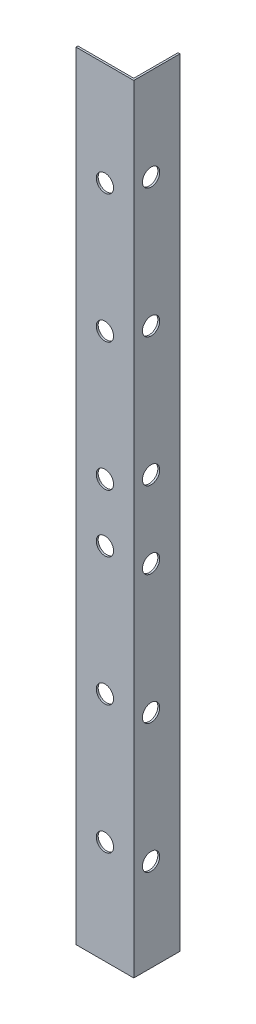
ISO-10303-21;
HEADER;
FILE_DESCRIPTION(('STEP AP214'),'2;1');
FILE_NAME('part.step','',(''),(''),'','','');
FILE_SCHEMA(('AUTOMOTIVE_DESIGN { 1 0 10303 214 1 1 1 1 }'));
ENDSEC;
DATA;
#1=APPLICATION_CONTEXT('core data for automotive mechanical design processes');
#2=APPLICATION_PROTOCOL_DEFINITION('international standard','automotive_design',2000,#1);
#3=PRODUCT_CONTEXT('',#1,'mechanical');
#4=PRODUCT('Part','Part','',(#3));
#5=PRODUCT_RELATED_PRODUCT_CATEGORY('part','',(#4));
#6=PRODUCT_DEFINITION_FORMATION('','',#4);
#7=PRODUCT_DEFINITION_CONTEXT('part definition',#1,'design');
#8=PRODUCT_DEFINITION('design','',#6,#7);
#9=PRODUCT_DEFINITION_SHAPE('','',#8);
#10=(LENGTH_UNIT() NAMED_UNIT(*) SI_UNIT(.MILLI.,.METRE.));
#11=(NAMED_UNIT(*) PLANE_ANGLE_UNIT() SI_UNIT($,.RADIAN.));
#12=(NAMED_UNIT(*) SI_UNIT($,.STERADIAN.) SOLID_ANGLE_UNIT());
#13=UNCERTAINTY_MEASURE_WITH_UNIT(LENGTH_MEASURE(1.E-05),#10,'distance_accuracy_value','');
#14=(GEOMETRIC_REPRESENTATION_CONTEXT(3) GLOBAL_UNCERTAINTY_ASSIGNED_CONTEXT((#13)) GLOBAL_UNIT_ASSIGNED_CONTEXT((#10,
#11,#12)) REPRESENTATION_CONTEXT('',''));
#15=CARTESIAN_POINT('',(0.,0.,0.));
#16=DIRECTION('',(0.,0.,1.));
#17=DIRECTION('',(1.,0.,0.));
#18=AXIS2_PLACEMENT_3D('',#15,#16,#17);
#19=CARTESIAN_POINT('',(0.,202.,-0.5));
#20=DIRECTION('',(1.,0.,0.));
#21=DIRECTION('',(0.,0.,-1.));
#22=AXIS2_PLACEMENT_3D('',#19,#20,#21);
#23=PLANE('',#22);
#24=DIRECTION('',(0.,0.,1.));
#25=VECTOR('',#24,1.);
#26=CARTESIAN_POINT('',(0.,0.,-0.5));
#27=LINE('',#26,#25);
#28=CARTESIAN_POINT('',(0.,0.,-0.5));
#29=VERTEX_POINT('',#28);
#30=CARTESIAN_POINT('',(0.,0.,0.));
#31=VERTEX_POINT('',#30);
#32=EDGE_CURVE('E123',#29,#31,#27,.T.);
#33=ORIENTED_EDGE('',*,*,#32,.T.);
#34=DIRECTION('',(0.,-1.,0.));
#35=VECTOR('',#34,1.);
#36=CARTESIAN_POINT('',(0.,202.,0.));
#37=LINE('',#36,#35);
#38=CARTESIAN_POINT('',(0.,202.,0.));
#39=VERTEX_POINT('',#38);
#40=EDGE_CURVE('E11',#39,#31,#37,.T.);
#41=ORIENTED_EDGE('',*,*,#40,.F.);
#42=DIRECTION('',(0.,0.,1.));
#43=VECTOR('',#42,1.);
#44=CARTESIAN_POINT('',(0.,202.,-0.5));
#45=LINE('',#44,#43);
#46=CARTESIAN_POINT('',(0.,202.,-0.5));
#47=VERTEX_POINT('',#46);
#48=EDGE_CURVE('E134',#47,#39,#45,.T.);
#49=ORIENTED_EDGE('',*,*,#48,.F.);
#50=DIRECTION('',(0.,-1.,0.));
#51=VECTOR('',#50,1.);
#52=CARTESIAN_POINT('',(0.,202.,-0.5));
#53=LINE('',#52,#51);
#54=EDGE_CURVE('E119',#47,#29,#53,.T.);
#55=ORIENTED_EDGE('',*,*,#54,.T.);
#56=EDGE_LOOP('',(#33,#41,#49,#55));
#57=FACE_BOUND('',#56,.T.);
#58=ADVANCED_FACE('F39',(#57),#23,.F.);
#59=CARTESIAN_POINT('',(0.,202.,0.));
#60=DIRECTION('',(0.,0.,-1.));
#61=DIRECTION('',(-1.,0.,0.));
#62=AXIS2_PLACEMENT_3D('',#59,#60,#61);
#63=PLANE('',#62);
#64=CARTESIAN_POINT('',(7.50000000000005,175.166666666667,0.));
#65=DIRECTION('',(0.,0.,1.));
#66=DIRECTION('',(1.,0.,0.));
#67=AXIS2_PLACEMENT_3D('',#64,#65,#66);
#68=CIRCLE('',#67,2.24999999999998);
#69=CARTESIAN_POINT('',(9.75000000000003,175.166666666667,0.));
#70=VERTEX_POINT('',#69);
#71=EDGE_CURVE('E463',#70,#70,#68,.T.);
#72=ORIENTED_EDGE('',*,*,#71,.F.);
#73=EDGE_LOOP('',(#72));
#74=FACE_BOUND('',#73,.T.);
#75=CARTESIAN_POINT('',(7.50000000000005,141.833333333333,0.));
#76=DIRECTION('',(0.,0.,1.));
#77=DIRECTION('',(1.,0.,0.));
#78=AXIS2_PLACEMENT_3D('',#75,#76,#77);
#79=CIRCLE('',#78,2.25);
#80=CARTESIAN_POINT('',(9.75000000000005,141.833333333333,0.));
#81=VERTEX_POINT('',#80);
#82=EDGE_CURVE('E466',#81,#81,#79,.T.);
#83=ORIENTED_EDGE('',*,*,#82,.F.);
#84=EDGE_LOOP('',(#83));
#85=FACE_BOUND('',#84,.T.);
#86=CARTESIAN_POINT('',(7.50000000000005,108.5,0.));
#87=DIRECTION('',(0.,0.,1.));
#88=DIRECTION('',(1.,0.,0.));
#89=AXIS2_PLACEMENT_3D('',#86,#87,#88);
#90=CIRCLE('',#89,2.25);
#91=CARTESIAN_POINT('',(9.75000000000005,108.5,0.));
#92=VERTEX_POINT('',#91);
#93=EDGE_CURVE('E472',#92,#92,#90,.T.);
#94=ORIENTED_EDGE('',*,*,#93,.F.);
#95=EDGE_LOOP('',(#94));
#96=FACE_BOUND('',#95,.T.);
#97=CARTESIAN_POINT('',(7.50000000000005,93.5,0.));
#98=DIRECTION('',(0.,0.,1.));
#99=DIRECTION('',(1.,0.,0.));
#100=AXIS2_PLACEMENT_3D('',#97,#98,#99);
#101=CIRCLE('',#100,2.25);
#102=CARTESIAN_POINT('',(9.75000000000005,93.5,0.));
#103=VERTEX_POINT('',#102);
#104=EDGE_CURVE('E478',#103,#103,#101,.T.);
#105=ORIENTED_EDGE('',*,*,#104,.F.);
#106=EDGE_LOOP('',(#105));
#107=FACE_BOUND('',#106,.T.);
#108=CARTESIAN_POINT('',(7.50000000000005,60.1666666666667,0.));
#109=DIRECTION('',(0.,0.,1.));
#110=DIRECTION('',(1.,0.,0.));
#111=AXIS2_PLACEMENT_3D('',#108,#109,#110);
#112=CIRCLE('',#111,2.24999999999998);
#113=CARTESIAN_POINT('',(9.75000000000003,60.1666666666667,0.));
#114=VERTEX_POINT('',#113);
#115=EDGE_CURVE('E484',#114,#114,#112,.T.);
#116=ORIENTED_EDGE('',*,*,#115,.F.);
#117=EDGE_LOOP('',(#116));
#118=FACE_BOUND('',#117,.T.);
#119=CARTESIAN_POINT('',(7.50000000000005,26.8333333333334,0.));
#120=DIRECTION('',(0.,0.,1.));
#121=DIRECTION('',(1.,0.,0.));
#122=AXIS2_PLACEMENT_3D('',#119,#120,#121);
#123=CIRCLE('',#122,2.24999999999999);
#124=CARTESIAN_POINT('',(9.75000000000004,26.8333333333334,0.));
#125=VERTEX_POINT('',#124);
#126=EDGE_CURVE('E429',#125,#125,#123,.T.);
#127=ORIENTED_EDGE('',*,*,#126,.F.);
#128=EDGE_LOOP('',(#127));
#129=FACE_BOUND('',#128,.T.);
#130=DIRECTION('',(1.,0.,0.));
#131=VECTOR('',#130,1.);
#132=CARTESIAN_POINT('',(0.,0.,0.));
#133=LINE('',#132,#131);
#134=CARTESIAN_POINT('',(15.,0.,0.));
#135=VERTEX_POINT('',#134);
#136=EDGE_CURVE('E126',#31,#135,#133,.T.);
#137=ORIENTED_EDGE('',*,*,#136,.T.);
#138=DIRECTION('',(0.,-1.,0.));
#139=VECTOR('',#138,1.);
#140=CARTESIAN_POINT('',(15.,202.,0.));
#141=LINE('',#140,#139);
#142=CARTESIAN_POINT('',(15.,202.,0.));
#143=VERTEX_POINT('',#142);
#144=EDGE_CURVE('E47',#143,#135,#141,.T.);
#145=ORIENTED_EDGE('',*,*,#144,.F.);
#146=DIRECTION('',(1.,0.,0.));
#147=VECTOR('',#146,1.);
#148=CARTESIAN_POINT('',(0.,202.,0.));
#149=LINE('',#148,#147);
#150=EDGE_CURVE('E92',#39,#143,#149,.T.);
#151=ORIENTED_EDGE('',*,*,#150,.F.);
#152=ORIENTED_EDGE('',*,*,#40,.T.);
#153=EDGE_LOOP('',(#137,#145,#151,#152));
#154=FACE_BOUND('',#153,.T.);
#155=ADVANCED_FACE('F164',(#74,#85,#96,#107,#118,#129,#154),#63,.F.);
#156=CARTESIAN_POINT('',(15.,202.,0.));
#157=DIRECTION('',(-1.,0.,0.));
#158=DIRECTION('',(0.,0.,1.));
#159=AXIS2_PLACEMENT_3D('',#156,#157,#158);
#160=PLANE('',#159);
#161=CARTESIAN_POINT('',(15.,23.9999999999999,-4.50000000000011));
#162=DIRECTION('',(1.,0.,0.));
#163=DIRECTION('',(0.,0.,-1.));
#164=AXIS2_PLACEMENT_3D('',#161,#162,#163);
#165=CIRCLE('',#164,2.24999999999999);
#166=CARTESIAN_POINT('',(15.,23.9999999999999,-6.7500000000001));
#167=VERTEX_POINT('',#166);
#168=EDGE_CURVE('E422',#167,#167,#165,.T.);
#169=ORIENTED_EDGE('',*,*,#168,.F.);
#170=EDGE_LOOP('',(#169));
#171=FACE_BOUND('',#170,.T.);
#172=CARTESIAN_POINT('',(15.,57.4999999999999,-4.50000000000011));
#173=DIRECTION('',(1.,0.,0.));
#174=DIRECTION('',(0.,0.,-1.));
#175=AXIS2_PLACEMENT_3D('',#172,#173,#174);
#176=CIRCLE('',#175,2.24999999999999);
#177=CARTESIAN_POINT('',(15.,57.4999999999999,-6.7500000000001));
#178=VERTEX_POINT('',#177);
#179=EDGE_CURVE('E431',#178,#178,#176,.T.);
#180=ORIENTED_EDGE('',*,*,#179,.F.);
#181=EDGE_LOOP('',(#180));
#182=FACE_BOUND('',#181,.T.);
#183=CARTESIAN_POINT('',(15.,90.9999999999999,-4.50000000000006));
#184=DIRECTION('',(1.,0.,0.));
#185=DIRECTION('',(0.,0.,-1.));
#186=AXIS2_PLACEMENT_3D('',#183,#184,#185);
#187=CIRCLE('',#186,2.24999999999999);
#188=CARTESIAN_POINT('',(15.,90.9999999999999,-6.75000000000005));
#189=VERTEX_POINT('',#188);
#190=EDGE_CURVE('E437',#189,#189,#187,.T.);
#191=ORIENTED_EDGE('',*,*,#190,.F.);
#192=EDGE_LOOP('',(#191));
#193=FACE_BOUND('',#192,.T.);
#194=CARTESIAN_POINT('',(15.,111.,-4.50000000000006));
#195=DIRECTION('',(1.,0.,0.));
#196=DIRECTION('',(0.,0.,-1.));
#197=AXIS2_PLACEMENT_3D('',#194,#195,#196);
#198=CIRCLE('',#197,2.24999999999999);
#199=CARTESIAN_POINT('',(15.,111.,-6.75000000000005));
#200=VERTEX_POINT('',#199);
#201=EDGE_CURVE('E443',#200,#200,#198,.T.);
#202=ORIENTED_EDGE('',*,*,#201,.F.);
#203=EDGE_LOOP('',(#202));
#204=FACE_BOUND('',#203,.T.);
#205=CARTESIAN_POINT('',(15.,144.5,-4.50000000000011));
#206=DIRECTION('',(1.,0.,0.));
#207=DIRECTION('',(0.,0.,-1.));
#208=AXIS2_PLACEMENT_3D('',#205,#206,#207);
#209=CIRCLE('',#208,2.25);
#210=CARTESIAN_POINT('',(15.,144.5,-6.75000000000012));
#211=VERTEX_POINT('',#210);
#212=EDGE_CURVE('E449',#211,#211,#209,.T.);
#213=ORIENTED_EDGE('',*,*,#212,.F.);
#214=EDGE_LOOP('',(#213));
#215=FACE_BOUND('',#214,.T.);
#216=CARTESIAN_POINT('',(15.,178.,-4.50000000000011));
#217=DIRECTION('',(1.,0.,0.));
#218=DIRECTION('',(0.,0.,-1.));
#219=AXIS2_PLACEMENT_3D('',#216,#217,#218);
#220=CIRCLE('',#219,2.25);
#221=CARTESIAN_POINT('',(15.,178.,-6.75000000000012));
#222=VERTEX_POINT('',#221);
#223=EDGE_CURVE('E455',#222,#222,#220,.T.);
#224=ORIENTED_EDGE('',*,*,#223,.F.);
#225=EDGE_LOOP('',(#224));
#226=FACE_BOUND('',#225,.T.);
#227=DIRECTION('',(0.,0.,-1.));
#228=VECTOR('',#227,1.);
#229=CARTESIAN_POINT('',(15.,0.,0.));
#230=LINE('',#229,#228);
#231=CARTESIAN_POINT('',(15.,0.,-12.));
#232=VERTEX_POINT('',#231);
#233=EDGE_CURVE('E129',#135,#232,#230,.T.);
#234=ORIENTED_EDGE('',*,*,#233,.T.);
#235=DIRECTION('',(0.,-1.,0.));
#236=VECTOR('',#235,1.);
#237=CARTESIAN_POINT('',(15.,202.,-12.));
#238=LINE('',#237,#236);
#239=CARTESIAN_POINT('',(15.,202.,-12.));
#240=VERTEX_POINT('',#239);
#241=EDGE_CURVE('E114',#240,#232,#238,.T.);
#242=ORIENTED_EDGE('',*,*,#241,.F.);
#243=DIRECTION('',(0.,0.,-1.));
#244=VECTOR('',#243,1.);
#245=CARTESIAN_POINT('',(15.,202.,0.));
#246=LINE('',#245,#244);
#247=EDGE_CURVE('E105',#143,#240,#246,.T.);
#248=ORIENTED_EDGE('',*,*,#247,.F.);
#249=ORIENTED_EDGE('',*,*,#144,.T.);
#250=EDGE_LOOP('',(#234,#242,#248,#249));
#251=FACE_BOUND('',#250,.T.);
#252=ADVANCED_FACE('F140',(#171,#182,#193,#204,#215,#226,#251),#160,.F.);
#253=CARTESIAN_POINT('',(15.,202.,-12.));
#254=DIRECTION('',(0.,0.,1.));
#255=DIRECTION('',(1.,0.,0.));
#256=AXIS2_PLACEMENT_3D('',#253,#254,#255);
#257=PLANE('',#256);
#258=DIRECTION('',(-1.,0.,0.));
#259=VECTOR('',#258,1.);
#260=CARTESIAN_POINT('',(15.,0.,-12.));
#261=LINE('',#260,#259);
#262=CARTESIAN_POINT('',(14.5,0.,-12.));
#263=VERTEX_POINT('',#262);
#264=EDGE_CURVE('E113',#232,#263,#261,.T.);
#265=ORIENTED_EDGE('',*,*,#264,.T.);
#266=DIRECTION('',(0.,-1.,0.));
#267=VECTOR('',#266,1.);
#268=CARTESIAN_POINT('',(14.5,202.,-12.));
#269=LINE('',#268,#267);
#270=CARTESIAN_POINT('',(14.5,202.,-12.));
#271=VERTEX_POINT('',#270);
#272=EDGE_CURVE('E110',#271,#263,#269,.T.);
#273=ORIENTED_EDGE('',*,*,#272,.F.);
#274=DIRECTION('',(-1.,0.,0.));
#275=VECTOR('',#274,1.);
#276=CARTESIAN_POINT('',(15.,202.,-12.));
#277=LINE('',#276,#275);
#278=EDGE_CURVE('E99',#240,#271,#277,.T.);
#279=ORIENTED_EDGE('',*,*,#278,.F.);
#280=ORIENTED_EDGE('',*,*,#241,.T.);
#281=EDGE_LOOP('',(#265,#273,#279,#280));
#282=FACE_BOUND('',#281,.T.);
#283=ADVANCED_FACE('F111',(#282),#257,.F.);
#284=CARTESIAN_POINT('',(14.5,202.,-12.));
#285=DIRECTION('',(1.,0.,0.));
#286=DIRECTION('',(0.,0.,-1.));
#287=AXIS2_PLACEMENT_3D('',#284,#285,#286);
#288=PLANE('',#287);
#289=CARTESIAN_POINT('',(14.5,23.9999999999999,-4.50000000000011));
#290=DIRECTION('',(1.,0.,0.));
#291=DIRECTION('',(0.,0.,-1.));
#292=AXIS2_PLACEMENT_3D('',#289,#290,#291);
#293=CIRCLE('',#292,2.24999999999999);
#294=CARTESIAN_POINT('',(14.5,23.9999999999999,-6.7500000000001));
#295=VERTEX_POINT('',#294);
#296=EDGE_CURVE('E425',#295,#295,#293,.F.);
#297=ORIENTED_EDGE('',*,*,#296,.F.);
#298=EDGE_LOOP('',(#297));
#299=FACE_BOUND('',#298,.T.);
#300=CARTESIAN_POINT('',(14.5,57.4999999999999,-4.50000000000011));
#301=DIRECTION('',(1.,0.,0.));
#302=DIRECTION('',(0.,0.,-1.));
#303=AXIS2_PLACEMENT_3D('',#300,#301,#302);
#304=CIRCLE('',#303,2.24999999999999);
#305=CARTESIAN_POINT('',(14.5,57.4999999999999,-6.7500000000001));
#306=VERTEX_POINT('',#305);
#307=EDGE_CURVE('E434',#306,#306,#304,.F.);
#308=ORIENTED_EDGE('',*,*,#307,.F.);
#309=EDGE_LOOP('',(#308));
#310=FACE_BOUND('',#309,.T.);
#311=CARTESIAN_POINT('',(14.5,90.9999999999999,-4.50000000000006));
#312=DIRECTION('',(1.,0.,0.));
#313=DIRECTION('',(0.,0.,-1.));
#314=AXIS2_PLACEMENT_3D('',#311,#312,#313);
#315=CIRCLE('',#314,2.24999999999999);
#316=CARTESIAN_POINT('',(14.5,90.9999999999999,-6.75000000000005));
#317=VERTEX_POINT('',#316);
#318=EDGE_CURVE('E440',#317,#317,#315,.F.);
#319=ORIENTED_EDGE('',*,*,#318,.F.);
#320=EDGE_LOOP('',(#319));
#321=FACE_BOUND('',#320,.T.);
#322=CARTESIAN_POINT('',(14.5,111.,-4.50000000000006));
#323=DIRECTION('',(1.,0.,0.));
#324=DIRECTION('',(0.,0.,-1.));
#325=AXIS2_PLACEMENT_3D('',#322,#323,#324);
#326=CIRCLE('',#325,2.24999999999999);
#327=CARTESIAN_POINT('',(14.5,111.,-6.75000000000005));
#328=VERTEX_POINT('',#327);
#329=EDGE_CURVE('E446',#328,#328,#326,.F.);
#330=ORIENTED_EDGE('',*,*,#329,.F.);
#331=EDGE_LOOP('',(#330));
#332=FACE_BOUND('',#331,.T.);
#333=CARTESIAN_POINT('',(14.5,144.5,-4.50000000000011));
#334=DIRECTION('',(1.,0.,0.));
#335=DIRECTION('',(0.,0.,-1.));
#336=AXIS2_PLACEMENT_3D('',#333,#334,#335);
#337=CIRCLE('',#336,2.25);
#338=CARTESIAN_POINT('',(14.5,144.5,-6.75000000000012));
#339=VERTEX_POINT('',#338);
#340=EDGE_CURVE('E452',#339,#339,#337,.F.);
#341=ORIENTED_EDGE('',*,*,#340,.F.);
#342=EDGE_LOOP('',(#341));
#343=FACE_BOUND('',#342,.T.);
#344=CARTESIAN_POINT('',(14.5,178.,-4.50000000000011));
#345=DIRECTION('',(1.,0.,0.));
#346=DIRECTION('',(0.,0.,-1.));
#347=AXIS2_PLACEMENT_3D('',#344,#345,#346);
#348=CIRCLE('',#347,2.25);
#349=CARTESIAN_POINT('',(14.5,178.,-6.75000000000012));
#350=VERTEX_POINT('',#349);
#351=EDGE_CURVE('E458',#350,#350,#348,.F.);
#352=ORIENTED_EDGE('',*,*,#351,.F.);
#353=EDGE_LOOP('',(#352));
#354=FACE_BOUND('',#353,.T.);
#355=DIRECTION('',(0.,0.,1.));
#356=VECTOR('',#355,1.);
#357=CARTESIAN_POINT('',(14.5,0.,-12.));
#358=LINE('',#357,#356);
#359=CARTESIAN_POINT('',(14.5,0.,-0.500000000000002));
#360=VERTEX_POINT('',#359);
#361=EDGE_CURVE('E78',#263,#360,#358,.T.);
#362=ORIENTED_EDGE('',*,*,#361,.T.);
#363=DIRECTION('',(0.,-1.,0.));
#364=VECTOR('',#363,1.);
#365=CARTESIAN_POINT('',(14.5,202.,-0.500000000000002));
#366=LINE('',#365,#364);
#367=CARTESIAN_POINT('',(14.5,202.,-0.500000000000002));
#368=VERTEX_POINT('',#367);
#369=EDGE_CURVE('E115',#368,#360,#366,.T.);
#370=ORIENTED_EDGE('',*,*,#369,.F.);
#371=DIRECTION('',(0.,0.,1.));
#372=VECTOR('',#371,1.);
#373=CARTESIAN_POINT('',(14.5,202.,-12.));
#374=LINE('',#373,#372);
#375=EDGE_CURVE('E103',#271,#368,#374,.T.);
#376=ORIENTED_EDGE('',*,*,#375,.F.);
#377=ORIENTED_EDGE('',*,*,#272,.T.);
#378=EDGE_LOOP('',(#362,#370,#376,#377));
#379=FACE_BOUND('',#378,.T.);
#380=ADVANCED_FACE('F117',(#299,#310,#321,#332,#343,#354,#379),#288,.F.);
#381=CARTESIAN_POINT('',(14.5,202.,-0.500000000000002));
#382=DIRECTION('',(0.,0.,1.));
#383=DIRECTION('',(1.,0.,0.));
#384=AXIS2_PLACEMENT_3D('',#381,#382,#383);
#385=PLANE('',#384);
#386=CARTESIAN_POINT('',(7.50000000000005,175.166666666667,-0.500000000000002));
#387=DIRECTION('',(0.,0.,1.));
#388=DIRECTION('',(1.,0.,0.));
#389=AXIS2_PLACEMENT_3D('',#386,#387,#388);
#390=CIRCLE('',#389,2.24999999999998);
#391=CARTESIAN_POINT('',(9.75000000000003,175.166666666667,-0.500000000000002));
#392=VERTEX_POINT('',#391);
#393=EDGE_CURVE('E127',#392,#392,#390,.F.);
#394=ORIENTED_EDGE('',*,*,#393,.F.);
#395=EDGE_LOOP('',(#394));
#396=FACE_BOUND('',#395,.T.);
#397=CARTESIAN_POINT('',(7.50000000000005,141.833333333333,-0.500000000000002));
#398=DIRECTION('',(0.,0.,1.));
#399=DIRECTION('',(1.,0.,0.));
#400=AXIS2_PLACEMENT_3D('',#397,#398,#399);
#401=CIRCLE('',#400,2.25);
#402=CARTESIAN_POINT('',(9.75000000000005,141.833333333333,-0.500000000000002));
#403=VERTEX_POINT('',#402);
#404=EDGE_CURVE('E469',#403,#403,#401,.F.);
#405=ORIENTED_EDGE('',*,*,#404,.F.);
#406=EDGE_LOOP('',(#405));
#407=FACE_BOUND('',#406,.T.);
#408=CARTESIAN_POINT('',(7.50000000000005,108.5,-0.500000000000002));
#409=DIRECTION('',(0.,0.,1.));
#410=DIRECTION('',(1.,0.,0.));
#411=AXIS2_PLACEMENT_3D('',#408,#409,#410);
#412=CIRCLE('',#411,2.25);
#413=CARTESIAN_POINT('',(9.75000000000005,108.5,-0.500000000000002));
#414=VERTEX_POINT('',#413);
#415=EDGE_CURVE('E475',#414,#414,#412,.F.);
#416=ORIENTED_EDGE('',*,*,#415,.F.);
#417=EDGE_LOOP('',(#416));
#418=FACE_BOUND('',#417,.T.);
#419=CARTESIAN_POINT('',(7.50000000000005,93.5,-0.500000000000002));
#420=DIRECTION('',(0.,0.,1.));
#421=DIRECTION('',(1.,0.,0.));
#422=AXIS2_PLACEMENT_3D('',#419,#420,#421);
#423=CIRCLE('',#422,2.25);
#424=CARTESIAN_POINT('',(9.75000000000005,93.5,-0.500000000000002));
#425=VERTEX_POINT('',#424);
#426=EDGE_CURVE('E481',#425,#425,#423,.F.);
#427=ORIENTED_EDGE('',*,*,#426,.F.);
#428=EDGE_LOOP('',(#427));
#429=FACE_BOUND('',#428,.T.);
#430=CARTESIAN_POINT('',(7.50000000000005,60.1666666666667,-0.500000000000002));
#431=DIRECTION('',(0.,0.,1.));
#432=DIRECTION('',(1.,0.,0.));
#433=AXIS2_PLACEMENT_3D('',#430,#431,#432);
#434=CIRCLE('',#433,2.24999999999998);
#435=CARTESIAN_POINT('',(9.75000000000003,60.1666666666667,-0.500000000000002));
#436=VERTEX_POINT('',#435);
#437=EDGE_CURVE('E487',#436,#436,#434,.F.);
#438=ORIENTED_EDGE('',*,*,#437,.F.);
#439=EDGE_LOOP('',(#438));
#440=FACE_BOUND('',#439,.T.);
#441=CARTESIAN_POINT('',(7.50000000000005,26.8333333333334,-0.500000000000002));
#442=DIRECTION('',(0.,0.,1.));
#443=DIRECTION('',(1.,0.,0.));
#444=AXIS2_PLACEMENT_3D('',#441,#442,#443);
#445=CIRCLE('',#444,2.24999999999999);
#446=CARTESIAN_POINT('',(9.75000000000004,26.8333333333334,-0.500000000000002));
#447=VERTEX_POINT('',#446);
#448=EDGE_CURVE('E426',#447,#447,#445,.F.);
#449=ORIENTED_EDGE('',*,*,#448,.F.);
#450=EDGE_LOOP('',(#449));
#451=FACE_BOUND('',#450,.T.);
#452=DIRECTION('',(-1.,0.,0.));
#453=VECTOR('',#452,1.);
#454=CARTESIAN_POINT('',(14.5,0.,-0.500000000000002));
#455=LINE('',#454,#453);
#456=EDGE_CURVE('E84',#360,#29,#455,.T.);
#457=ORIENTED_EDGE('',*,*,#456,.T.);
#458=ORIENTED_EDGE('',*,*,#54,.F.);
#459=DIRECTION('',(-1.,0.,0.));
#460=VECTOR('',#459,1.);
#461=CARTESIAN_POINT('',(14.5,202.,-0.500000000000002));
#462=LINE('',#461,#460);
#463=EDGE_CURVE('E55',#368,#47,#462,.T.);
#464=ORIENTED_EDGE('',*,*,#463,.F.);
#465=ORIENTED_EDGE('',*,*,#369,.T.);
#466=EDGE_LOOP('',(#457,#458,#464,#465));
#467=FACE_BOUND('',#466,.T.);
#468=ADVANCED_FACE('F147',(#396,#407,#418,#429,#440,#451,#467),#385,.F.);
#469=CARTESIAN_POINT('',(0.,202.,0.));
#470=DIRECTION('',(0.,1.,0.));
#471=DIRECTION('',(0.,0.,1.));
#472=AXIS2_PLACEMENT_3D('',#469,#470,#471);
#473=PLANE('',#472);
#474=ORIENTED_EDGE('',*,*,#48,.T.);
#475=ORIENTED_EDGE('',*,*,#150,.T.);
#476=ORIENTED_EDGE('',*,*,#247,.T.);
#477=ORIENTED_EDGE('',*,*,#278,.T.);
#478=ORIENTED_EDGE('',*,*,#375,.T.);
#479=ORIENTED_EDGE('',*,*,#463,.T.);
#480=EDGE_LOOP('',(#474,#475,#476,#477,#478,#479));
#481=FACE_BOUND('',#480,.T.);
#482=ADVANCED_FACE('F101',(#481),#473,.T.);
#483=CARTESIAN_POINT('',(0.,0.,0.));
#484=DIRECTION('',(0.,1.,0.));
#485=DIRECTION('',(0.,0.,1.));
#486=AXIS2_PLACEMENT_3D('',#483,#484,#485);
#487=PLANE('',#486);
#488=ORIENTED_EDGE('',*,*,#32,.F.);
#489=ORIENTED_EDGE('',*,*,#456,.F.);
#490=ORIENTED_EDGE('',*,*,#361,.F.);
#491=ORIENTED_EDGE('',*,*,#264,.F.);
#492=ORIENTED_EDGE('',*,*,#233,.F.);
#493=ORIENTED_EDGE('',*,*,#136,.F.);
#494=EDGE_LOOP('',(#488,#489,#490,#491,#492,#493));
#495=FACE_BOUND('',#494,.T.);
#496=ADVANCED_FACE('F143',(#495),#487,.F.);
#497=CARTESIAN_POINT('',(7.50000000000005,26.8333333333334,-12.001));
#498=DIRECTION('',(0.,0.,1.));
#499=DIRECTION('',(1.,0.,0.));
#500=AXIS2_PLACEMENT_3D('',#497,#498,#499);
#501=CYLINDRICAL_SURFACE('',#500,2.24999999999999);
#502=ORIENTED_EDGE('',*,*,#126,.T.);
#503=EDGE_LOOP('',(#502));
#504=FACE_BOUND('',#503,.T.);
#505=ORIENTED_EDGE('',*,*,#448,.T.);
#506=EDGE_LOOP('',(#505));
#507=FACE_BOUND('',#506,.T.);
#508=ADVANCED_FACE('F204',(#504,#507),#501,.F.);
#509=CARTESIAN_POINT('',(7.50000000000005,60.1666666666667,-12.001));
#510=DIRECTION('',(0.,0.,1.));
#511=DIRECTION('',(1.,0.,0.));
#512=AXIS2_PLACEMENT_3D('',#509,#510,#511);
#513=CYLINDRICAL_SURFACE('',#512,2.24999999999998);
#514=ORIENTED_EDGE('',*,*,#115,.T.);
#515=EDGE_LOOP('',(#514));
#516=FACE_BOUND('',#515,.T.);
#517=ORIENTED_EDGE('',*,*,#437,.T.);
#518=EDGE_LOOP('',(#517));
#519=FACE_BOUND('',#518,.T.);
#520=ADVANCED_FACE('F209',(#516,#519),#513,.F.);
#521=CARTESIAN_POINT('',(7.50000000000005,93.5,-12.001));
#522=DIRECTION('',(0.,0.,1.));
#523=DIRECTION('',(1.,0.,0.));
#524=AXIS2_PLACEMENT_3D('',#521,#522,#523);
#525=CYLINDRICAL_SURFACE('',#524,2.25);
#526=ORIENTED_EDGE('',*,*,#104,.T.);
#527=EDGE_LOOP('',(#526));
#528=FACE_BOUND('',#527,.T.);
#529=ORIENTED_EDGE('',*,*,#426,.T.);
#530=EDGE_LOOP('',(#529));
#531=FACE_BOUND('',#530,.T.);
#532=ADVANCED_FACE('F216',(#528,#531),#525,.F.);
#533=CARTESIAN_POINT('',(7.50000000000005,108.5,-12.001));
#534=DIRECTION('',(0.,0.,1.));
#535=DIRECTION('',(1.,0.,0.));
#536=AXIS2_PLACEMENT_3D('',#533,#534,#535);
#537=CYLINDRICAL_SURFACE('',#536,2.25);
#538=ORIENTED_EDGE('',*,*,#93,.T.);
#539=EDGE_LOOP('',(#538));
#540=FACE_BOUND('',#539,.T.);
#541=ORIENTED_EDGE('',*,*,#415,.T.);
#542=EDGE_LOOP('',(#541));
#543=FACE_BOUND('',#542,.T.);
#544=ADVANCED_FACE('F224',(#540,#543),#537,.F.);
#545=CARTESIAN_POINT('',(7.50000000000005,141.833333333333,-12.001));
#546=DIRECTION('',(0.,0.,1.));
#547=DIRECTION('',(1.,0.,0.));
#548=AXIS2_PLACEMENT_3D('',#545,#546,#547);
#549=CYLINDRICAL_SURFACE('',#548,2.25);
#550=ORIENTED_EDGE('',*,*,#82,.T.);
#551=EDGE_LOOP('',(#550));
#552=FACE_BOUND('',#551,.T.);
#553=ORIENTED_EDGE('',*,*,#404,.T.);
#554=EDGE_LOOP('',(#553));
#555=FACE_BOUND('',#554,.T.);
#556=ADVANCED_FACE('F232',(#552,#555),#549,.F.);
#557=CARTESIAN_POINT('',(7.50000000000005,175.166666666667,-12.001));
#558=DIRECTION('',(0.,0.,1.));
#559=DIRECTION('',(1.,0.,0.));
#560=AXIS2_PLACEMENT_3D('',#557,#558,#559);
#561=CYLINDRICAL_SURFACE('',#560,2.24999999999998);
#562=ORIENTED_EDGE('',*,*,#71,.T.);
#563=EDGE_LOOP('',(#562));
#564=FACE_BOUND('',#563,.T.);
#565=ORIENTED_EDGE('',*,*,#393,.T.);
#566=EDGE_LOOP('',(#565));
#567=FACE_BOUND('',#566,.T.);
#568=ADVANCED_FACE('F240',(#564,#567),#561,.F.);
#569=CARTESIAN_POINT('',(-0.000999999999999265,178.,-4.50000000000012));
#570=DIRECTION('',(1.,0.,0.));
#571=DIRECTION('',(0.,0.,-1.));
#572=AXIS2_PLACEMENT_3D('',#569,#570,#571);
#573=CYLINDRICAL_SURFACE('',#572,2.25);
#574=ORIENTED_EDGE('',*,*,#223,.T.);
#575=EDGE_LOOP('',(#574));
#576=FACE_BOUND('',#575,.T.);
#577=ORIENTED_EDGE('',*,*,#351,.T.);
#578=EDGE_LOOP('',(#577));
#579=FACE_BOUND('',#578,.T.);
#580=ADVANCED_FACE('F248',(#576,#579),#573,.F.);
#581=CARTESIAN_POINT('',(-0.000999999999999265,144.5,-4.50000000000012));
#582=DIRECTION('',(1.,0.,0.));
#583=DIRECTION('',(0.,0.,-1.));
#584=AXIS2_PLACEMENT_3D('',#581,#582,#583);
#585=CYLINDRICAL_SURFACE('',#584,2.25);
#586=ORIENTED_EDGE('',*,*,#212,.T.);
#587=EDGE_LOOP('',(#586));
#588=FACE_BOUND('',#587,.T.);
#589=ORIENTED_EDGE('',*,*,#340,.T.);
#590=EDGE_LOOP('',(#589));
#591=FACE_BOUND('',#590,.T.);
#592=ADVANCED_FACE('F256',(#588,#591),#585,.F.);
#593=CARTESIAN_POINT('',(-0.000999999999999265,111.,-4.50000000000006));
#594=DIRECTION('',(1.,0.,0.));
#595=DIRECTION('',(0.,0.,-1.));
#596=AXIS2_PLACEMENT_3D('',#593,#594,#595);
#597=CYLINDRICAL_SURFACE('',#596,2.24999999999999);
#598=ORIENTED_EDGE('',*,*,#201,.T.);
#599=EDGE_LOOP('',(#598));
#600=FACE_BOUND('',#599,.T.);
#601=ORIENTED_EDGE('',*,*,#329,.T.);
#602=EDGE_LOOP('',(#601));
#603=FACE_BOUND('',#602,.T.);
#604=ADVANCED_FACE('F263',(#600,#603),#597,.F.);
#605=CARTESIAN_POINT('',(-0.000999999999999265,90.9999999999999,-4.50000000000006));
#606=DIRECTION('',(1.,0.,0.));
#607=DIRECTION('',(0.,0.,-1.));
#608=AXIS2_PLACEMENT_3D('',#605,#606,#607);
#609=CYLINDRICAL_SURFACE('',#608,2.24999999999999);
#610=ORIENTED_EDGE('',*,*,#190,.T.);
#611=EDGE_LOOP('',(#610));
#612=FACE_BOUND('',#611,.T.);
#613=ORIENTED_EDGE('',*,*,#318,.T.);
#614=EDGE_LOOP('',(#613));
#615=FACE_BOUND('',#614,.T.);
#616=ADVANCED_FACE('F271',(#612,#615),#609,.F.);
#617=CARTESIAN_POINT('',(-0.000999999999999265,57.4999999999999,-4.50000000000012));
#618=DIRECTION('',(1.,0.,0.));
#619=DIRECTION('',(0.,0.,-1.));
#620=AXIS2_PLACEMENT_3D('',#617,#618,#619);
#621=CYLINDRICAL_SURFACE('',#620,2.24999999999999);
#622=ORIENTED_EDGE('',*,*,#179,.T.);
#623=EDGE_LOOP('',(#622));
#624=FACE_BOUND('',#623,.T.);
#625=ORIENTED_EDGE('',*,*,#307,.T.);
#626=EDGE_LOOP('',(#625));
#627=FACE_BOUND('',#626,.T.);
#628=ADVANCED_FACE('F279',(#624,#627),#621,.F.);
#629=CARTESIAN_POINT('',(-0.000999999999999265,23.9999999999999,-4.50000000000012));
#630=DIRECTION('',(1.,0.,0.));
#631=DIRECTION('',(0.,0.,-1.));
#632=AXIS2_PLACEMENT_3D('',#629,#630,#631);
#633=CYLINDRICAL_SURFACE('',#632,2.24999999999999);
#634=ORIENTED_EDGE('',*,*,#168,.T.);
#635=EDGE_LOOP('',(#634));
#636=FACE_BOUND('',#635,.T.);
#637=ORIENTED_EDGE('',*,*,#296,.T.);
#638=EDGE_LOOP('',(#637));
#639=FACE_BOUND('',#638,.T.);
#640=ADVANCED_FACE('F287',(#636,#639),#633,.F.);
#641=CLOSED_SHELL('',(#58,#155,#252,#283,#380,#468,#482,#496,#508,#520,#532,#544,#556,#568,#580,
#592,#604,#616,#628,#640));
#642=MANIFOLD_SOLID_BREP('B2',#641);
#643=ADVANCED_BREP_SHAPE_REPRESENTATION('',(#18,#642),#14);
#644=SHAPE_DEFINITION_REPRESENTATION(#9,#643);
ENDSEC;
END-ISO-10303-21;
